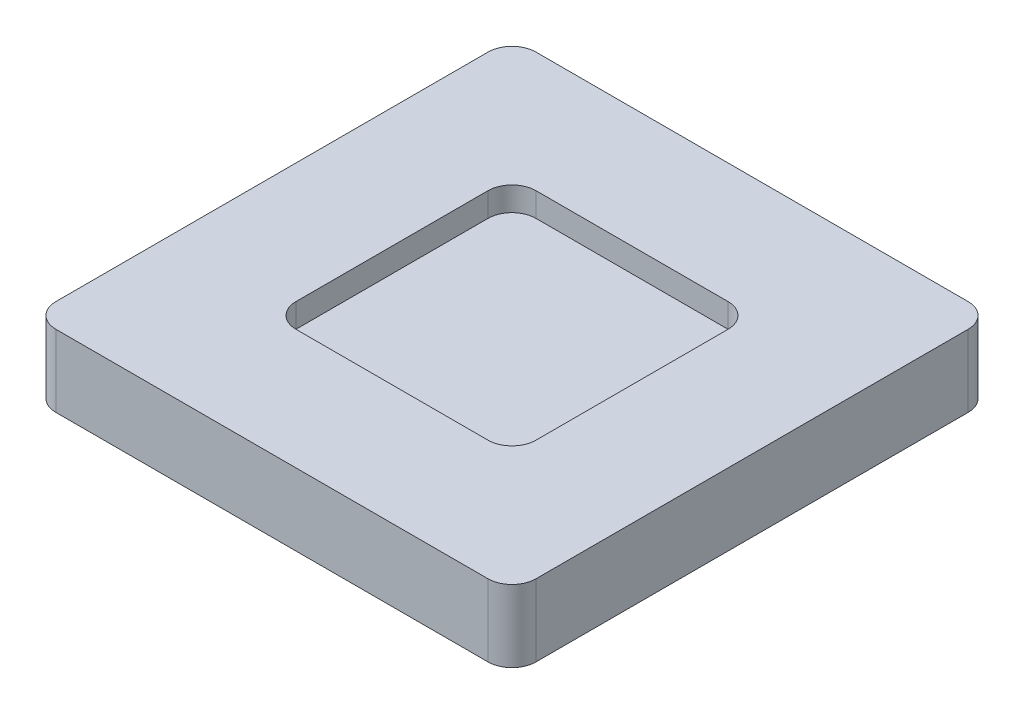
ISO-10303-21;
HEADER;
FILE_DESCRIPTION(('STEP AP214'),'2;1');
FILE_NAME('part.step','',(''),(''),'','','');
FILE_SCHEMA(('AUTOMOTIVE_DESIGN { 1 0 10303 214 1 1 1 1 }'));
ENDSEC;
DATA;
#1=APPLICATION_CONTEXT('core data for automotive mechanical design processes');
#2=APPLICATION_PROTOCOL_DEFINITION('international standard','automotive_design',2000,#1);
#3=PRODUCT_CONTEXT('',#1,'mechanical');
#4=PRODUCT('Part','Part','',(#3));
#5=PRODUCT_RELATED_PRODUCT_CATEGORY('part','',(#4));
#6=PRODUCT_DEFINITION_FORMATION('','',#4);
#7=PRODUCT_DEFINITION_CONTEXT('part definition',#1,'design');
#8=PRODUCT_DEFINITION('design','',#6,#7);
#9=PRODUCT_DEFINITION_SHAPE('','',#8);
#10=(LENGTH_UNIT() NAMED_UNIT(*) SI_UNIT(.MILLI.,.METRE.));
#11=(NAMED_UNIT(*) PLANE_ANGLE_UNIT() SI_UNIT($,.RADIAN.));
#12=(NAMED_UNIT(*) SI_UNIT($,.STERADIAN.) SOLID_ANGLE_UNIT());
#13=UNCERTAINTY_MEASURE_WITH_UNIT(LENGTH_MEASURE(1.E-05),#10,'distance_accuracy_value','');
#14=(GEOMETRIC_REPRESENTATION_CONTEXT(3) GLOBAL_UNCERTAINTY_ASSIGNED_CONTEXT((#13)) GLOBAL_UNIT_ASSIGNED_CONTEXT((#10,
#11,#12)) REPRESENTATION_CONTEXT('',''));
#15=CARTESIAN_POINT('',(0.,0.,0.));
#16=DIRECTION('',(0.,0.,1.));
#17=DIRECTION('',(1.,0.,0.));
#18=AXIS2_PLACEMENT_3D('',#15,#16,#17);
#19=CARTESIAN_POINT('',(-10.,3.,-9.99999999999999));
#20=DIRECTION('',(1.,0.,0.));
#21=DIRECTION('',(0.,0.,-1.));
#22=AXIS2_PLACEMENT_3D('',#19,#20,#21);
#23=PLANE('',#22);
#24=DIRECTION('',(0.,0.,1.));
#25=VECTOR('',#24,1.);
#26=CARTESIAN_POINT('',(-10.,3.,-9.99999999999999));
#27=LINE('',#26,#25);
#28=CARTESIAN_POINT('',(-10.,3.,-8.99999999999999));
#29=VERTEX_POINT('',#28);
#30=CARTESIAN_POINT('',(-10.,3.,9.00000000000001));
#31=VERTEX_POINT('',#30);
#32=EDGE_CURVE('E192',#29,#31,#27,.T.);
#33=ORIENTED_EDGE('',*,*,#32,.F.);
#34=DIRECTION('',(0.,-1.,0.));
#35=VECTOR('',#34,1.);
#36=CARTESIAN_POINT('',(-10.,3.,-8.99999999999999));
#37=LINE('',#36,#35);
#38=CARTESIAN_POINT('',(-10.,0.,-8.99999999999999));
#39=VERTEX_POINT('',#38);
#40=EDGE_CURVE('E237',#29,#39,#37,.T.);
#41=ORIENTED_EDGE('',*,*,#40,.T.);
#42=DIRECTION('',(0.,0.,1.));
#43=VECTOR('',#42,1.);
#44=CARTESIAN_POINT('',(-10.,0.,-9.99999999999999));
#45=LINE('',#44,#43);
#46=CARTESIAN_POINT('',(-10.,0.,9.00000000000001));
#47=VERTEX_POINT('',#46);
#48=EDGE_CURVE('E203',#39,#47,#45,.T.);
#49=ORIENTED_EDGE('',*,*,#48,.T.);
#50=DIRECTION('',(0.,-1.,0.));
#51=VECTOR('',#50,1.);
#52=CARTESIAN_POINT('',(-10.,3.,9.00000000000001));
#53=LINE('',#52,#51);
#54=EDGE_CURVE('E235',#47,#31,#53,.F.);
#55=ORIENTED_EDGE('',*,*,#54,.T.);
#56=EDGE_LOOP('',(#33,#41,#49,#55));
#57=FACE_BOUND('',#56,.T.);
#58=ADVANCED_FACE('F41',(#57),#23,.F.);
#59=CARTESIAN_POINT('',(10.,3.,10.));
#60=DIRECTION('',(0.,0.,-1.));
#61=DIRECTION('',(-1.,0.,0.));
#62=AXIS2_PLACEMENT_3D('',#59,#60,#61);
#63=PLANE('',#62);
#64=DIRECTION('',(1.,0.,0.));
#65=VECTOR('',#64,1.);
#66=CARTESIAN_POINT('',(10.,0.,10.));
#67=LINE('',#66,#65);
#68=CARTESIAN_POINT('',(-9.,0.,10.));
#69=VERTEX_POINT('',#68);
#70=CARTESIAN_POINT('',(9.,0.,10.));
#71=VERTEX_POINT('',#70);
#72=EDGE_CURVE('E206',#69,#71,#67,.T.);
#73=ORIENTED_EDGE('',*,*,#72,.T.);
#74=DIRECTION('',(0.,-1.,0.));
#75=VECTOR('',#74,1.);
#76=CARTESIAN_POINT('',(9.,3.,10.));
#77=LINE('',#76,#75);
#78=CARTESIAN_POINT('',(9.,3.,10.));
#79=VERTEX_POINT('',#78);
#80=EDGE_CURVE('E166',#71,#79,#77,.F.);
#81=ORIENTED_EDGE('',*,*,#80,.T.);
#82=DIRECTION('',(1.,0.,0.));
#83=VECTOR('',#82,1.);
#84=CARTESIAN_POINT('',(10.,3.,10.));
#85=LINE('',#84,#83);
#86=CARTESIAN_POINT('',(-9.,3.,10.));
#87=VERTEX_POINT('',#86);
#88=EDGE_CURVE('E195',#87,#79,#85,.T.);
#89=ORIENTED_EDGE('',*,*,#88,.F.);
#90=DIRECTION('',(0.,-1.,0.));
#91=VECTOR('',#90,1.);
#92=CARTESIAN_POINT('',(-9.,3.,10.));
#93=LINE('',#92,#91);
#94=EDGE_CURVE('E264',#87,#69,#93,.T.);
#95=ORIENTED_EDGE('',*,*,#94,.T.);
#96=EDGE_LOOP('',(#73,#81,#89,#95));
#97=FACE_BOUND('',#96,.T.);
#98=ADVANCED_FACE('F317',(#97),#63,.F.);
#99=CARTESIAN_POINT('',(10.,3.,-9.99999999999999));
#100=DIRECTION('',(-1.,0.,0.));
#101=DIRECTION('',(0.,0.,1.));
#102=AXIS2_PLACEMENT_3D('',#99,#100,#101);
#103=PLANE('',#102);
#104=DIRECTION('',(0.,0.,-1.));
#105=VECTOR('',#104,1.);
#106=CARTESIAN_POINT('',(10.,0.,-9.99999999999999));
#107=LINE('',#106,#105);
#108=CARTESIAN_POINT('',(10.,0.,9.00000000000001));
#109=VERTEX_POINT('',#108);
#110=CARTESIAN_POINT('',(10.,0.,-8.99999999999999));
#111=VERTEX_POINT('',#110);
#112=EDGE_CURVE('E209',#109,#111,#107,.T.);
#113=ORIENTED_EDGE('',*,*,#112,.T.);
#114=DIRECTION('',(0.,-1.,0.));
#115=VECTOR('',#114,1.);
#116=CARTESIAN_POINT('',(10.,3.,-8.99999999999999));
#117=LINE('',#116,#115);
#118=CARTESIAN_POINT('',(10.,3.,-8.99999999999999));
#119=VERTEX_POINT('',#118);
#120=EDGE_CURVE('E56',#111,#119,#117,.F.);
#121=ORIENTED_EDGE('',*,*,#120,.T.);
#122=DIRECTION('',(0.,0.,-1.));
#123=VECTOR('',#122,1.);
#124=CARTESIAN_POINT('',(10.,3.,-9.99999999999999));
#125=LINE('',#124,#123);
#126=CARTESIAN_POINT('',(10.,3.,9.00000000000001));
#127=VERTEX_POINT('',#126);
#128=EDGE_CURVE('E198',#127,#119,#125,.T.);
#129=ORIENTED_EDGE('',*,*,#128,.F.);
#130=DIRECTION('',(0.,-1.,0.));
#131=VECTOR('',#130,1.);
#132=CARTESIAN_POINT('',(10.,3.,9.00000000000001));
#133=LINE('',#132,#131);
#134=EDGE_CURVE('E260',#127,#109,#133,.T.);
#135=ORIENTED_EDGE('',*,*,#134,.T.);
#136=EDGE_LOOP('',(#113,#121,#129,#135));
#137=FACE_BOUND('',#136,.T.);
#138=ADVANCED_FACE('F323',(#137),#103,.F.);
#139=CARTESIAN_POINT('',(10.,3.,-9.99999999999999));
#140=DIRECTION('',(0.,0.,1.));
#141=DIRECTION('',(1.,0.,0.));
#142=AXIS2_PLACEMENT_3D('',#139,#140,#141);
#143=PLANE('',#142);
#144=DIRECTION('',(-1.,0.,0.));
#145=VECTOR('',#144,1.);
#146=CARTESIAN_POINT('',(10.,0.,-9.99999999999999));
#147=LINE('',#146,#145);
#148=CARTESIAN_POINT('',(9.,0.,-9.99999999999999));
#149=VERTEX_POINT('',#148);
#150=CARTESIAN_POINT('',(-9.,0.,-9.99999999999999));
#151=VERTEX_POINT('',#150);
#152=EDGE_CURVE('E196',#149,#151,#147,.T.);
#153=ORIENTED_EDGE('',*,*,#152,.T.);
#154=DIRECTION('',(0.,-1.,0.));
#155=VECTOR('',#154,1.);
#156=CARTESIAN_POINT('',(-9.,3.,-9.99999999999999));
#157=LINE('',#156,#155);
#158=CARTESIAN_POINT('',(-9.,3.,-9.99999999999999));
#159=VERTEX_POINT('',#158);
#160=EDGE_CURVE('E251',#151,#159,#157,.F.);
#161=ORIENTED_EDGE('',*,*,#160,.T.);
#162=DIRECTION('',(-1.,0.,0.));
#163=VECTOR('',#162,1.);
#164=CARTESIAN_POINT('',(10.,3.,-9.99999999999999));
#165=LINE('',#164,#163);
#166=CARTESIAN_POINT('',(9.,3.,-9.99999999999999));
#167=VERTEX_POINT('',#166);
#168=EDGE_CURVE('E200',#167,#159,#165,.T.);
#169=ORIENTED_EDGE('',*,*,#168,.F.);
#170=DIRECTION('',(0.,-1.,0.));
#171=VECTOR('',#170,1.);
#172=CARTESIAN_POINT('',(9.,3.,-9.99999999999999));
#173=LINE('',#172,#171);
#174=EDGE_CURVE('E248',#167,#149,#173,.T.);
#175=ORIENTED_EDGE('',*,*,#174,.T.);
#176=EDGE_LOOP('',(#153,#161,#169,#175));
#177=FACE_BOUND('',#176,.T.);
#178=ADVANCED_FACE('F388',(#177),#143,.F.);
#179=CARTESIAN_POINT('',(0.,3.,0.));
#180=DIRECTION('',(0.,-1.,0.));
#181=DIRECTION('',(0.,0.,-1.));
#182=AXIS2_PLACEMENT_3D('',#179,#180,#181);
#183=PLANE('',#182);
#184=DIRECTION('',(1.,0.,0.));
#185=VECTOR('',#184,1.);
#186=CARTESIAN_POINT('',(5.,3.,5.));
#187=LINE('',#186,#185);
#188=CARTESIAN_POINT('',(-4.,3.,5.));
#189=VERTEX_POINT('',#188);
#190=CARTESIAN_POINT('',(4.,3.,5.));
#191=VERTEX_POINT('',#190);
#192=EDGE_CURVE('E188',#189,#191,#187,.T.);
#193=ORIENTED_EDGE('',*,*,#192,.F.);
#194=CARTESIAN_POINT('',(-4.,3.,4.));
#195=DIRECTION('',(0.,-1.,0.));
#196=DIRECTION('',(0.,0.,-1.));
#197=AXIS2_PLACEMENT_3D('',#194,#195,#196);
#198=CIRCLE('',#197,1.);
#199=CARTESIAN_POINT('',(-5.,3.,4.));
#200=VERTEX_POINT('',#199);
#201=EDGE_CURVE('E165',#189,#200,#198,.T.);
#202=ORIENTED_EDGE('',*,*,#201,.T.);
#203=DIRECTION('',(0.,0.,1.));
#204=VECTOR('',#203,1.);
#205=CARTESIAN_POINT('',(-5.,3.,-5.));
#206=LINE('',#205,#204);
#207=CARTESIAN_POINT('',(-5.,3.,-4.));
#208=VERTEX_POINT('',#207);
#209=EDGE_CURVE('E277',#208,#200,#206,.T.);
#210=ORIENTED_EDGE('',*,*,#209,.F.);
#211=CARTESIAN_POINT('',(-4.,3.,-4.));
#212=DIRECTION('',(0.,-1.,0.));
#213=DIRECTION('',(0.,0.,-1.));
#214=AXIS2_PLACEMENT_3D('',#211,#212,#213);
#215=CIRCLE('',#214,1.);
#216=CARTESIAN_POINT('',(-4.,3.,-5.));
#217=VERTEX_POINT('',#216);
#218=EDGE_CURVE('E12',#208,#217,#215,.T.);
#219=ORIENTED_EDGE('',*,*,#218,.T.);
#220=DIRECTION('',(-1.,0.,0.));
#221=VECTOR('',#220,1.);
#222=CARTESIAN_POINT('',(5.,3.,-5.));
#223=LINE('',#222,#221);
#224=CARTESIAN_POINT('',(4.,3.,-5.));
#225=VERTEX_POINT('',#224);
#226=EDGE_CURVE('E172',#225,#217,#223,.T.);
#227=ORIENTED_EDGE('',*,*,#226,.F.);
#228=CARTESIAN_POINT('',(4.,3.,-4.));
#229=DIRECTION('',(0.,-1.,0.));
#230=DIRECTION('',(0.,0.,-1.));
#231=AXIS2_PLACEMENT_3D('',#228,#229,#230);
#232=CIRCLE('',#231,1.);
#233=CARTESIAN_POINT('',(5.,3.,-4.));
#234=VERTEX_POINT('',#233);
#235=EDGE_CURVE('E155',#225,#234,#232,.T.);
#236=ORIENTED_EDGE('',*,*,#235,.T.);
#237=DIRECTION('',(0.,0.,-1.));
#238=VECTOR('',#237,1.);
#239=CARTESIAN_POINT('',(5.,3.,-5.));
#240=LINE('',#239,#238);
#241=CARTESIAN_POINT('',(5.,3.,4.));
#242=VERTEX_POINT('',#241);
#243=EDGE_CURVE('E183',#242,#234,#240,.T.);
#244=ORIENTED_EDGE('',*,*,#243,.F.);
#245=CARTESIAN_POINT('',(4.,3.,4.));
#246=DIRECTION('',(0.,-1.,0.));
#247=DIRECTION('',(0.,0.,-1.));
#248=AXIS2_PLACEMENT_3D('',#245,#246,#247);
#249=CIRCLE('',#248,1.);
#250=EDGE_CURVE('E49',#242,#191,#249,.T.);
#251=ORIENTED_EDGE('',*,*,#250,.T.);
#252=EDGE_LOOP('',(#193,#202,#210,#219,#227,#236,#244,#251));
#253=FACE_BOUND('',#252,.T.);
#254=ORIENTED_EDGE('',*,*,#168,.T.);
#255=CARTESIAN_POINT('',(-9.,3.,-8.99999999999999));
#256=DIRECTION('',(0.,-1.,0.));
#257=DIRECTION('',(0.,0.,-1.));
#258=AXIS2_PLACEMENT_3D('',#255,#256,#257);
#259=CIRCLE('',#258,1.);
#260=EDGE_CURVE('E258',#159,#29,#259,.F.);
#261=ORIENTED_EDGE('',*,*,#260,.T.);
#262=ORIENTED_EDGE('',*,*,#32,.T.);
#263=CARTESIAN_POINT('',(-9.,3.,9.00000000000001));
#264=DIRECTION('',(0.,-1.,0.));
#265=DIRECTION('',(0.,0.,-1.));
#266=AXIS2_PLACEMENT_3D('',#263,#264,#265);
#267=CIRCLE('',#266,1.);
#268=EDGE_CURVE('E253',#31,#87,#267,.F.);
#269=ORIENTED_EDGE('',*,*,#268,.T.);
#270=ORIENTED_EDGE('',*,*,#88,.T.);
#271=CARTESIAN_POINT('',(9.,3.,9.00000000000001));
#272=DIRECTION('',(0.,-1.,0.));
#273=DIRECTION('',(0.,0.,-1.));
#274=AXIS2_PLACEMENT_3D('',#271,#272,#273);
#275=CIRCLE('',#274,1.);
#276=EDGE_CURVE('E63',#79,#127,#275,.F.);
#277=ORIENTED_EDGE('',*,*,#276,.T.);
#278=ORIENTED_EDGE('',*,*,#128,.T.);
#279=CARTESIAN_POINT('',(9.,3.,-8.99999999999999));
#280=DIRECTION('',(0.,-1.,0.));
#281=DIRECTION('',(0.,0.,-1.));
#282=AXIS2_PLACEMENT_3D('',#279,#280,#281);
#283=CIRCLE('',#282,1.);
#284=EDGE_CURVE('E256',#119,#167,#283,.F.);
#285=ORIENTED_EDGE('',*,*,#284,.T.);
#286=EDGE_LOOP('',(#254,#261,#262,#269,#270,#277,#278,#285));
#287=FACE_BOUND('',#286,.T.);
#288=ADVANCED_FACE('F180',(#253,#287),#183,.F.);
#289=CARTESIAN_POINT('',(0.,0.,0.));
#290=DIRECTION('',(0.,-1.,0.));
#291=DIRECTION('',(0.,0.,-1.));
#292=AXIS2_PLACEMENT_3D('',#289,#290,#291);
#293=PLANE('',#292);
#294=ORIENTED_EDGE('',*,*,#48,.F.);
#295=CARTESIAN_POINT('',(-9.,0.,-8.99999999999999));
#296=DIRECTION('',(0.,-1.,0.));
#297=DIRECTION('',(0.,0.,-1.));
#298=AXIS2_PLACEMENT_3D('',#295,#296,#297);
#299=CIRCLE('',#298,1.);
#300=EDGE_CURVE('E246',#39,#151,#299,.T.);
#301=ORIENTED_EDGE('',*,*,#300,.T.);
#302=ORIENTED_EDGE('',*,*,#152,.F.);
#303=CARTESIAN_POINT('',(9.,0.,-8.99999999999999));
#304=DIRECTION('',(0.,-1.,0.));
#305=DIRECTION('',(0.,0.,-1.));
#306=AXIS2_PLACEMENT_3D('',#303,#304,#305);
#307=CIRCLE('',#306,1.);
#308=EDGE_CURVE('E244',#149,#111,#307,.T.);
#309=ORIENTED_EDGE('',*,*,#308,.T.);
#310=ORIENTED_EDGE('',*,*,#112,.F.);
#311=CARTESIAN_POINT('',(9.,0.,9.00000000000001));
#312=DIRECTION('',(0.,-1.,0.));
#313=DIRECTION('',(0.,0.,-1.));
#314=AXIS2_PLACEMENT_3D('',#311,#312,#313);
#315=CIRCLE('',#314,1.);
#316=EDGE_CURVE('E242',#109,#71,#315,.T.);
#317=ORIENTED_EDGE('',*,*,#316,.T.);
#318=ORIENTED_EDGE('',*,*,#72,.F.);
#319=CARTESIAN_POINT('',(-9.,0.,9.00000000000001));
#320=DIRECTION('',(0.,-1.,0.));
#321=DIRECTION('',(0.,0.,-1.));
#322=AXIS2_PLACEMENT_3D('',#319,#320,#321);
#323=CIRCLE('',#322,1.);
#324=EDGE_CURVE('E240',#69,#47,#323,.T.);
#325=ORIENTED_EDGE('',*,*,#324,.T.);
#326=EDGE_LOOP('',(#294,#301,#302,#309,#310,#317,#318,#325));
#327=FACE_BOUND('',#326,.T.);
#328=ADVANCED_FACE('F382',(#327),#293,.T.);
#329=CARTESIAN_POINT('',(-5.,2.,-5.));
#330=DIRECTION('',(-1.,0.,0.));
#331=DIRECTION('',(0.,0.,1.));
#332=AXIS2_PLACEMENT_3D('',#329,#330,#331);
#333=PLANE('',#332);
#334=ORIENTED_EDGE('',*,*,#209,.T.);
#335=DIRECTION('',(0.,1.,0.));
#336=VECTOR('',#335,1.);
#337=CARTESIAN_POINT('',(-5.,2.,4.));
#338=LINE('',#337,#336);
#339=CARTESIAN_POINT('',(-5.,2.,4.));
#340=VERTEX_POINT('',#339);
#341=EDGE_CURVE('E233',#200,#340,#338,.F.);
#342=ORIENTED_EDGE('',*,*,#341,.T.);
#343=DIRECTION('',(0.,0.,1.));
#344=VECTOR('',#343,1.);
#345=CARTESIAN_POINT('',(-5.,2.,-5.));
#346=LINE('',#345,#344);
#347=CARTESIAN_POINT('',(-5.,2.,-4.));
#348=VERTEX_POINT('',#347);
#349=EDGE_CURVE('E182',#348,#340,#346,.T.);
#350=ORIENTED_EDGE('',*,*,#349,.F.);
#351=DIRECTION('',(0.,1.,0.));
#352=VECTOR('',#351,1.);
#353=CARTESIAN_POINT('',(-5.,3.,-4.));
#354=LINE('',#353,#352);
#355=EDGE_CURVE('E230',#348,#208,#354,.T.);
#356=ORIENTED_EDGE('',*,*,#355,.T.);
#357=EDGE_LOOP('',(#334,#342,#350,#356));
#358=FACE_BOUND('',#357,.T.);
#359=ADVANCED_FACE('F294',(#358),#333,.F.);
#360=CARTESIAN_POINT('',(5.,2.,-5.));
#361=DIRECTION('',(0.,0.,-1.));
#362=DIRECTION('',(-1.,0.,0.));
#363=AXIS2_PLACEMENT_3D('',#360,#361,#362);
#364=PLANE('',#363);
#365=DIRECTION('',(-1.,0.,0.));
#366=VECTOR('',#365,1.);
#367=CARTESIAN_POINT('',(5.,2.,-5.));
#368=LINE('',#367,#366);
#369=CARTESIAN_POINT('',(4.,2.,-5.));
#370=VERTEX_POINT('',#369);
#371=CARTESIAN_POINT('',(-4.,2.,-5.));
#372=VERTEX_POINT('',#371);
#373=EDGE_CURVE('E175',#370,#372,#368,.T.);
#374=ORIENTED_EDGE('',*,*,#373,.F.);
#375=DIRECTION('',(0.,1.,0.));
#376=VECTOR('',#375,1.);
#377=CARTESIAN_POINT('',(4.,3.,-5.));
#378=LINE('',#377,#376);
#379=EDGE_CURVE('E159',#370,#225,#378,.T.);
#380=ORIENTED_EDGE('',*,*,#379,.T.);
#381=ORIENTED_EDGE('',*,*,#226,.T.);
#382=DIRECTION('',(0.,1.,0.));
#383=VECTOR('',#382,1.);
#384=CARTESIAN_POINT('',(-4.,2.,-5.));
#385=LINE('',#384,#383);
#386=EDGE_CURVE('E177',#217,#372,#385,.F.);
#387=ORIENTED_EDGE('',*,*,#386,.T.);
#388=EDGE_LOOP('',(#374,#380,#381,#387));
#389=FACE_BOUND('',#388,.T.);
#390=ADVANCED_FACE('F171',(#389),#364,.F.);
#391=CARTESIAN_POINT('',(5.,2.,-5.));
#392=DIRECTION('',(1.,0.,0.));
#393=DIRECTION('',(0.,0.,-1.));
#394=AXIS2_PLACEMENT_3D('',#391,#392,#393);
#395=PLANE('',#394);
#396=ORIENTED_EDGE('',*,*,#243,.T.);
#397=DIRECTION('',(0.,1.,0.));
#398=VECTOR('',#397,1.);
#399=CARTESIAN_POINT('',(5.,2.,-4.));
#400=LINE('',#399,#398);
#401=CARTESIAN_POINT('',(5.,2.,-4.));
#402=VERTEX_POINT('',#401);
#403=EDGE_CURVE('E160',#234,#402,#400,.F.);
#404=ORIENTED_EDGE('',*,*,#403,.T.);
#405=DIRECTION('',(0.,0.,-1.));
#406=VECTOR('',#405,1.);
#407=CARTESIAN_POINT('',(5.,2.,-5.));
#408=LINE('',#407,#406);
#409=CARTESIAN_POINT('',(5.,2.,4.));
#410=VERTEX_POINT('',#409);
#411=EDGE_CURVE('E284',#410,#402,#408,.T.);
#412=ORIENTED_EDGE('',*,*,#411,.F.);
#413=DIRECTION('',(0.,1.,0.));
#414=VECTOR('',#413,1.);
#415=CARTESIAN_POINT('',(5.,3.,4.));
#416=LINE('',#415,#414);
#417=EDGE_CURVE('E176',#410,#242,#416,.T.);
#418=ORIENTED_EDGE('',*,*,#417,.T.);
#419=EDGE_LOOP('',(#396,#404,#412,#418));
#420=FACE_BOUND('',#419,.T.);
#421=ADVANCED_FACE('F286',(#420),#395,.F.);
#422=CARTESIAN_POINT('',(5.,2.,5.));
#423=DIRECTION('',(0.,0.,1.));
#424=DIRECTION('',(1.,0.,0.));
#425=AXIS2_PLACEMENT_3D('',#422,#423,#424);
#426=PLANE('',#425);
#427=DIRECTION('',(1.,0.,0.));
#428=VECTOR('',#427,1.);
#429=CARTESIAN_POINT('',(5.,2.,5.));
#430=LINE('',#429,#428);
#431=CARTESIAN_POINT('',(-4.,2.,5.));
#432=VERTEX_POINT('',#431);
#433=CARTESIAN_POINT('',(4.,2.,5.));
#434=VERTEX_POINT('',#433);
#435=EDGE_CURVE('E187',#432,#434,#430,.T.);
#436=ORIENTED_EDGE('',*,*,#435,.F.);
#437=DIRECTION('',(0.,1.,0.));
#438=VECTOR('',#437,1.);
#439=CARTESIAN_POINT('',(-4.,3.,5.));
#440=LINE('',#439,#438);
#441=EDGE_CURVE('E227',#432,#189,#440,.T.);
#442=ORIENTED_EDGE('',*,*,#441,.T.);
#443=ORIENTED_EDGE('',*,*,#192,.T.);
#444=DIRECTION('',(0.,1.,0.));
#445=VECTOR('',#444,1.);
#446=CARTESIAN_POINT('',(4.,2.,5.));
#447=LINE('',#446,#445);
#448=EDGE_CURVE('E225',#191,#434,#447,.F.);
#449=ORIENTED_EDGE('',*,*,#448,.T.);
#450=EDGE_LOOP('',(#436,#442,#443,#449));
#451=FACE_BOUND('',#450,.T.);
#452=ADVANCED_FACE('F274',(#451),#426,.F.);
#453=CARTESIAN_POINT('',(0.,2.,0.));
#454=DIRECTION('',(0.,-1.,0.));
#455=DIRECTION('',(0.,0.,-1.));
#456=AXIS2_PLACEMENT_3D('',#453,#454,#455);
#457=PLANE('',#456);
#458=ORIENTED_EDGE('',*,*,#411,.T.);
#459=CARTESIAN_POINT('',(4.,2.,-4.));
#460=DIRECTION('',(0.,-1.,0.));
#461=DIRECTION('',(0.,0.,-1.));
#462=AXIS2_PLACEMENT_3D('',#459,#460,#461);
#463=CIRCLE('',#462,1.);
#464=EDGE_CURVE('E223',#402,#370,#463,.F.);
#465=ORIENTED_EDGE('',*,*,#464,.T.);
#466=ORIENTED_EDGE('',*,*,#373,.T.);
#467=CARTESIAN_POINT('',(-4.,2.,-4.));
#468=DIRECTION('',(0.,-1.,0.));
#469=DIRECTION('',(0.,0.,-1.));
#470=AXIS2_PLACEMENT_3D('',#467,#468,#469);
#471=CIRCLE('',#470,1.);
#472=EDGE_CURVE('E217',#372,#348,#471,.F.);
#473=ORIENTED_EDGE('',*,*,#472,.T.);
#474=ORIENTED_EDGE('',*,*,#349,.T.);
#475=CARTESIAN_POINT('',(-4.,2.,4.));
#476=DIRECTION('',(0.,-1.,0.));
#477=DIRECTION('',(0.,0.,-1.));
#478=AXIS2_PLACEMENT_3D('',#475,#476,#477);
#479=CIRCLE('',#478,1.);
#480=EDGE_CURVE('E221',#340,#432,#479,.F.);
#481=ORIENTED_EDGE('',*,*,#480,.T.);
#482=ORIENTED_EDGE('',*,*,#435,.T.);
#483=CARTESIAN_POINT('',(4.,2.,4.));
#484=DIRECTION('',(0.,-1.,0.));
#485=DIRECTION('',(0.,0.,-1.));
#486=AXIS2_PLACEMENT_3D('',#483,#484,#485);
#487=CIRCLE('',#486,1.);
#488=EDGE_CURVE('E219',#434,#410,#487,.F.);
#489=ORIENTED_EDGE('',*,*,#488,.T.);
#490=EDGE_LOOP('',(#458,#465,#466,#473,#474,#481,#482,#489));
#491=FACE_BOUND('',#490,.T.);
#492=ADVANCED_FACE('F283',(#491),#457,.F.);
#493=CARTESIAN_POINT('',(4.,2.,-4.));
#494=DIRECTION('',(0.,-1.,0.));
#495=DIRECTION('',(0.,0.,-1.));
#496=AXIS2_PLACEMENT_3D('',#493,#494,#495);
#497=CYLINDRICAL_SURFACE('',#496,1.);
#498=ORIENTED_EDGE('',*,*,#464,.F.);
#499=ORIENTED_EDGE('',*,*,#403,.F.);
#500=ORIENTED_EDGE('',*,*,#235,.F.);
#501=ORIENTED_EDGE('',*,*,#379,.F.);
#502=EDGE_LOOP('',(#498,#499,#500,#501));
#503=FACE_BOUND('',#502,.T.);
#504=ADVANCED_FACE('F158',(#503),#497,.F.);
#505=CARTESIAN_POINT('',(-4.,2.,4.));
#506=DIRECTION('',(0.,-1.,0.));
#507=DIRECTION('',(0.,0.,-1.));
#508=AXIS2_PLACEMENT_3D('',#505,#506,#507);
#509=CYLINDRICAL_SURFACE('',#508,1.);
#510=ORIENTED_EDGE('',*,*,#480,.F.);
#511=ORIENTED_EDGE('',*,*,#341,.F.);
#512=ORIENTED_EDGE('',*,*,#201,.F.);
#513=ORIENTED_EDGE('',*,*,#441,.F.);
#514=EDGE_LOOP('',(#510,#511,#512,#513));
#515=FACE_BOUND('',#514,.T.);
#516=ADVANCED_FACE('F299',(#515),#509,.F.);
#517=CARTESIAN_POINT('',(4.,2.,4.));
#518=DIRECTION('',(0.,-1.,0.));
#519=DIRECTION('',(0.,0.,-1.));
#520=AXIS2_PLACEMENT_3D('',#517,#518,#519);
#521=CYLINDRICAL_SURFACE('',#520,1.);
#522=ORIENTED_EDGE('',*,*,#488,.F.);
#523=ORIENTED_EDGE('',*,*,#448,.F.);
#524=ORIENTED_EDGE('',*,*,#250,.F.);
#525=ORIENTED_EDGE('',*,*,#417,.F.);
#526=EDGE_LOOP('',(#522,#523,#524,#525));
#527=FACE_BOUND('',#526,.T.);
#528=ADVANCED_FACE('F279',(#527),#521,.F.);
#529=CARTESIAN_POINT('',(-9.,3.,-8.99999999999999));
#530=DIRECTION('',(0.,-1.,0.));
#531=DIRECTION('',(0.,0.,-1.));
#532=AXIS2_PLACEMENT_3D('',#529,#530,#531);
#533=CYLINDRICAL_SURFACE('',#532,1.);
#534=ORIENTED_EDGE('',*,*,#260,.F.);
#535=ORIENTED_EDGE('',*,*,#160,.F.);
#536=ORIENTED_EDGE('',*,*,#300,.F.);
#537=ORIENTED_EDGE('',*,*,#40,.F.);
#538=EDGE_LOOP('',(#534,#535,#536,#537));
#539=FACE_BOUND('',#538,.T.);
#540=ADVANCED_FACE('F305',(#539),#533,.T.);
#541=CARTESIAN_POINT('',(-4.,2.,-4.));
#542=DIRECTION('',(0.,-1.,0.));
#543=DIRECTION('',(0.,0.,-1.));
#544=AXIS2_PLACEMENT_3D('',#541,#542,#543);
#545=CYLINDRICAL_SURFACE('',#544,1.);
#546=ORIENTED_EDGE('',*,*,#472,.F.);
#547=ORIENTED_EDGE('',*,*,#386,.F.);
#548=ORIENTED_EDGE('',*,*,#218,.F.);
#549=ORIENTED_EDGE('',*,*,#355,.F.);
#550=EDGE_LOOP('',(#546,#547,#548,#549));
#551=FACE_BOUND('',#550,.T.);
#552=ADVANCED_FACE('F302',(#551),#545,.F.);
#553=CARTESIAN_POINT('',(9.,3.,-8.99999999999999));
#554=DIRECTION('',(0.,-1.,0.));
#555=DIRECTION('',(0.,0.,-1.));
#556=AXIS2_PLACEMENT_3D('',#553,#554,#555);
#557=CYLINDRICAL_SURFACE('',#556,1.);
#558=ORIENTED_EDGE('',*,*,#284,.F.);
#559=ORIENTED_EDGE('',*,*,#120,.F.);
#560=ORIENTED_EDGE('',*,*,#308,.F.);
#561=ORIENTED_EDGE('',*,*,#174,.F.);
#562=EDGE_LOOP('',(#558,#559,#560,#561));
#563=FACE_BOUND('',#562,.T.);
#564=ADVANCED_FACE('F304',(#563),#557,.T.);
#565=CARTESIAN_POINT('',(9.,3.,9.00000000000001));
#566=DIRECTION('',(0.,-1.,0.));
#567=DIRECTION('',(0.,0.,-1.));
#568=AXIS2_PLACEMENT_3D('',#565,#566,#567);
#569=CYLINDRICAL_SURFACE('',#568,1.);
#570=ORIENTED_EDGE('',*,*,#276,.F.);
#571=ORIENTED_EDGE('',*,*,#80,.F.);
#572=ORIENTED_EDGE('',*,*,#316,.F.);
#573=ORIENTED_EDGE('',*,*,#134,.F.);
#574=EDGE_LOOP('',(#570,#571,#572,#573));
#575=FACE_BOUND('',#574,.T.);
#576=ADVANCED_FACE('F311',(#575),#569,.T.);
#577=CARTESIAN_POINT('',(-9.,3.,9.00000000000001));
#578=DIRECTION('',(0.,-1.,0.));
#579=DIRECTION('',(0.,0.,-1.));
#580=AXIS2_PLACEMENT_3D('',#577,#578,#579);
#581=CYLINDRICAL_SURFACE('',#580,1.);
#582=ORIENTED_EDGE('',*,*,#268,.F.);
#583=ORIENTED_EDGE('',*,*,#54,.F.);
#584=ORIENTED_EDGE('',*,*,#324,.F.);
#585=ORIENTED_EDGE('',*,*,#94,.F.);
#586=EDGE_LOOP('',(#582,#583,#584,#585));
#587=FACE_BOUND('',#586,.T.);
#588=ADVANCED_FACE('F43',(#587),#581,.T.);
#589=CLOSED_SHELL('',(#58,#98,#138,#178,#288,#328,#359,#390,#421,#452,#492,#504,#516,#528,#540,
#552,#564,#576,#588));
#590=MANIFOLD_SOLID_BREP('B2',#589);
#591=ADVANCED_BREP_SHAPE_REPRESENTATION('',(#18,#590),#14);
#592=SHAPE_DEFINITION_REPRESENTATION(#9,#591);
ENDSEC;
END-ISO-10303-21;
